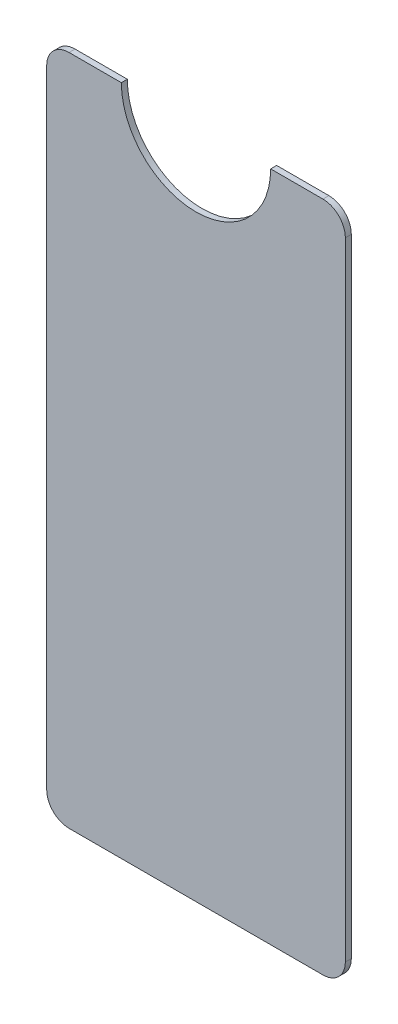
ISO-10303-21;
HEADER;
FILE_DESCRIPTION(('STEP AP214'),'2;1');
FILE_NAME('part.step','',(''),(''),'','','');
FILE_SCHEMA(('AUTOMOTIVE_DESIGN { 1 0 10303 214 1 1 1 1 }'));
ENDSEC;
DATA;
#1=APPLICATION_CONTEXT('core data for automotive mechanical design processes');
#2=APPLICATION_PROTOCOL_DEFINITION('international standard','automotive_design',2000,#1);
#3=PRODUCT_CONTEXT('',#1,'mechanical');
#4=PRODUCT('Part','Part','',(#3));
#5=PRODUCT_RELATED_PRODUCT_CATEGORY('part','',(#4));
#6=PRODUCT_DEFINITION_FORMATION('','',#4);
#7=PRODUCT_DEFINITION_CONTEXT('part definition',#1,'design');
#8=PRODUCT_DEFINITION('design','',#6,#7);
#9=PRODUCT_DEFINITION_SHAPE('','',#8);
#10=(LENGTH_UNIT() NAMED_UNIT(*) SI_UNIT(.MILLI.,.METRE.));
#11=(NAMED_UNIT(*) PLANE_ANGLE_UNIT() SI_UNIT($,.RADIAN.));
#12=(NAMED_UNIT(*) SI_UNIT($,.STERADIAN.) SOLID_ANGLE_UNIT());
#13=UNCERTAINTY_MEASURE_WITH_UNIT(LENGTH_MEASURE(1.E-05),#10,'distance_accuracy_value','');
#14=(GEOMETRIC_REPRESENTATION_CONTEXT(3) GLOBAL_UNCERTAINTY_ASSIGNED_CONTEXT((#13)) GLOBAL_UNIT_ASSIGNED_CONTEXT((#10,
#11,#12)) REPRESENTATION_CONTEXT('',''));
#15=CARTESIAN_POINT('',(0.,0.,0.));
#16=DIRECTION('',(0.,0.,1.));
#17=DIRECTION('',(1.,0.,0.));
#18=AXIS2_PLACEMENT_3D('',#15,#16,#17);
#19=CARTESIAN_POINT('',(20.,90.,0.8));
#20=DIRECTION('',(0.,0.,-1.));
#21=DIRECTION('',(-1.,0.,0.));
#22=AXIS2_PLACEMENT_3D('',#19,#20,#21);
#23=CYLINDRICAL_SURFACE('',#22,10.);
#24=CARTESIAN_POINT('',(20.,90.,0.));
#25=DIRECTION('',(0.,0.,-1.));
#26=DIRECTION('',(1.,0.,0.));
#27=AXIS2_PLACEMENT_3D('',#24,#25,#26);
#28=CIRCLE('',#27,10.);
#29=CARTESIAN_POINT('',(30.,90.,0.));
#30=VERTEX_POINT('',#29);
#31=CARTESIAN_POINT('',(10.,90.,0.));
#32=VERTEX_POINT('',#31);
#33=EDGE_CURVE('E152',#30,#32,#28,.T.);
#34=ORIENTED_EDGE('',*,*,#33,.T.);
#35=DIRECTION('',(0.,0.,-1.));
#36=VECTOR('',#35,1.);
#37=CARTESIAN_POINT('',(10.,90.,0.8));
#38=LINE('',#37,#36);
#39=CARTESIAN_POINT('',(10.,90.,0.8));
#40=VERTEX_POINT('',#39);
#41=EDGE_CURVE('E11',#40,#32,#38,.T.);
#42=ORIENTED_EDGE('',*,*,#41,.F.);
#43=CARTESIAN_POINT('',(20.,90.,0.8));
#44=DIRECTION('',(0.,0.,-1.));
#45=DIRECTION('',(1.,0.,0.));
#46=AXIS2_PLACEMENT_3D('',#43,#44,#45);
#47=CIRCLE('',#46,10.);
#48=CARTESIAN_POINT('',(30.,90.,0.8));
#49=VERTEX_POINT('',#48);
#50=EDGE_CURVE('E180',#49,#40,#47,.T.);
#51=ORIENTED_EDGE('',*,*,#50,.F.);
#52=DIRECTION('',(0.,0.,-1.));
#53=VECTOR('',#52,1.);
#54=CARTESIAN_POINT('',(30.,90.,0.8));
#55=LINE('',#54,#53);
#56=EDGE_CURVE('E148',#49,#30,#55,.T.);
#57=ORIENTED_EDGE('',*,*,#56,.T.);
#58=EDGE_LOOP('',(#34,#42,#51,#57));
#59=FACE_BOUND('',#58,.T.);
#60=ADVANCED_FACE('F39',(#59),#23,.F.);
#61=CARTESIAN_POINT('',(3.00000000000002,90.,0.8));
#62=DIRECTION('',(0.,-1.,0.));
#63=DIRECTION('',(1.,0.,0.));
#64=AXIS2_PLACEMENT_3D('',#61,#62,#63);
#65=PLANE('',#64);
#66=DIRECTION('',(-1.,0.,0.));
#67=VECTOR('',#66,1.);
#68=CARTESIAN_POINT('',(3.00000000000002,90.,0.));
#69=LINE('',#68,#67);
#70=CARTESIAN_POINT('',(3.00000000000002,90.,0.));
#71=VERTEX_POINT('',#70);
#72=EDGE_CURVE('E156',#32,#71,#69,.T.);
#73=ORIENTED_EDGE('',*,*,#72,.T.);
#74=DIRECTION('',(0.,0.,-1.));
#75=VECTOR('',#74,1.);
#76=CARTESIAN_POINT('',(3.00000000000002,90.,0.8));
#77=LINE('',#76,#75);
#78=CARTESIAN_POINT('',(3.00000000000002,90.,0.8));
#79=VERTEX_POINT('',#78);
#80=EDGE_CURVE('E48',#79,#71,#77,.T.);
#81=ORIENTED_EDGE('',*,*,#80,.F.);
#82=DIRECTION('',(-1.,0.,0.));
#83=VECTOR('',#82,1.);
#84=CARTESIAN_POINT('',(3.00000000000002,90.,0.8));
#85=LINE('',#84,#83);
#86=EDGE_CURVE('E105',#40,#79,#85,.T.);
#87=ORIENTED_EDGE('',*,*,#86,.F.);
#88=ORIENTED_EDGE('',*,*,#41,.T.);
#89=EDGE_LOOP('',(#73,#81,#87,#88));
#90=FACE_BOUND('',#89,.T.);
#91=ADVANCED_FACE('F244',(#90),#65,.F.);
#92=CARTESIAN_POINT('',(3.,87.,0.8));
#93=DIRECTION('',(0.,0.,-1.));
#94=DIRECTION('',(-1.,0.,0.));
#95=AXIS2_PLACEMENT_3D('',#92,#93,#94);
#96=CYLINDRICAL_SURFACE('',#95,2.99999999999999);
#97=CARTESIAN_POINT('',(3.,87.,0.));
#98=DIRECTION('',(0.,0.,1.));
#99=DIRECTION('',(-1.,0.,0.));
#100=AXIS2_PLACEMENT_3D('',#97,#98,#99);
#101=CIRCLE('',#100,2.99999999999999);
#102=CARTESIAN_POINT('',(0.,87.,0.));
#103=VERTEX_POINT('',#102);
#104=EDGE_CURVE('E159',#71,#103,#101,.T.);
#105=ORIENTED_EDGE('',*,*,#104,.T.);
#106=DIRECTION('',(0.,0.,-1.));
#107=VECTOR('',#106,1.);
#108=CARTESIAN_POINT('',(0.,87.,0.8));
#109=LINE('',#108,#107);
#110=CARTESIAN_POINT('',(0.,87.,0.8));
#111=VERTEX_POINT('',#110);
#112=EDGE_CURVE('E199',#111,#103,#109,.T.);
#113=ORIENTED_EDGE('',*,*,#112,.F.);
#114=CARTESIAN_POINT('',(3.,87.,0.8));
#115=DIRECTION('',(0.,0.,1.));
#116=DIRECTION('',(-1.,0.,0.));
#117=AXIS2_PLACEMENT_3D('',#114,#115,#116);
#118=CIRCLE('',#117,2.99999999999999);
#119=EDGE_CURVE('E209',#79,#111,#118,.T.);
#120=ORIENTED_EDGE('',*,*,#119,.F.);
#121=ORIENTED_EDGE('',*,*,#80,.T.);
#122=EDGE_LOOP('',(#105,#113,#120,#121));
#123=FACE_BOUND('',#122,.T.);
#124=ADVANCED_FACE('F207',(#123),#96,.T.);
#125=CARTESIAN_POINT('',(0.,3.00000000000002,0.8));
#126=DIRECTION('',(1.,0.,0.));
#127=DIRECTION('',(0.,0.,-1.));
#128=AXIS2_PLACEMENT_3D('',#125,#126,#127);
#129=PLANE('',#128);
#130=DIRECTION('',(0.,-1.,0.));
#131=VECTOR('',#130,1.);
#132=CARTESIAN_POINT('',(0.,3.00000000000002,0.));
#133=LINE('',#132,#131);
#134=CARTESIAN_POINT('',(0.,3.00000000000002,0.));
#135=VERTEX_POINT('',#134);
#136=EDGE_CURVE('E162',#103,#135,#133,.T.);
#137=ORIENTED_EDGE('',*,*,#136,.T.);
#138=DIRECTION('',(0.,0.,-1.));
#139=VECTOR('',#138,1.);
#140=CARTESIAN_POINT('',(0.,3.00000000000002,0.8));
#141=LINE('',#140,#139);
#142=CARTESIAN_POINT('',(0.,3.00000000000002,0.8));
#143=VERTEX_POINT('',#142);
#144=EDGE_CURVE('E195',#143,#135,#141,.T.);
#145=ORIENTED_EDGE('',*,*,#144,.F.);
#146=DIRECTION('',(0.,-1.,0.));
#147=VECTOR('',#146,1.);
#148=CARTESIAN_POINT('',(0.,3.00000000000002,0.8));
#149=LINE('',#148,#147);
#150=EDGE_CURVE('E228',#111,#143,#149,.T.);
#151=ORIENTED_EDGE('',*,*,#150,.F.);
#152=ORIENTED_EDGE('',*,*,#112,.T.);
#153=EDGE_LOOP('',(#137,#145,#151,#152));
#154=FACE_BOUND('',#153,.T.);
#155=ADVANCED_FACE('F218',(#154),#129,.F.);
#156=CARTESIAN_POINT('',(3.,3.,0.8));
#157=DIRECTION('',(0.,0.,-1.));
#158=DIRECTION('',(-1.,0.,0.));
#159=AXIS2_PLACEMENT_3D('',#156,#157,#158);
#160=CYLINDRICAL_SURFACE('',#159,3.);
#161=CARTESIAN_POINT('',(3.,3.,0.));
#162=DIRECTION('',(0.,0.,1.));
#163=DIRECTION('',(1.,0.,0.));
#164=AXIS2_PLACEMENT_3D('',#161,#162,#163);
#165=CIRCLE('',#164,3.);
#166=CARTESIAN_POINT('',(3.00000000000002,0.,0.));
#167=VERTEX_POINT('',#166);
#168=EDGE_CURVE('E165',#135,#167,#165,.T.);
#169=ORIENTED_EDGE('',*,*,#168,.T.);
#170=DIRECTION('',(0.,0.,-1.));
#171=VECTOR('',#170,1.);
#172=CARTESIAN_POINT('',(3.00000000000002,0.,0.8));
#173=LINE('',#172,#171);
#174=CARTESIAN_POINT('',(3.00000000000002,0.,0.8));
#175=VERTEX_POINT('',#174);
#176=EDGE_CURVE('E191',#175,#167,#173,.T.);
#177=ORIENTED_EDGE('',*,*,#176,.F.);
#178=CARTESIAN_POINT('',(3.,3.,0.8));
#179=DIRECTION('',(0.,0.,1.));
#180=DIRECTION('',(1.,0.,0.));
#181=AXIS2_PLACEMENT_3D('',#178,#179,#180);
#182=CIRCLE('',#181,3.);
#183=EDGE_CURVE('E224',#143,#175,#182,.T.);
#184=ORIENTED_EDGE('',*,*,#183,.F.);
#185=ORIENTED_EDGE('',*,*,#144,.T.);
#186=EDGE_LOOP('',(#169,#177,#184,#185));
#187=FACE_BOUND('',#186,.T.);
#188=ADVANCED_FACE('F222',(#187),#160,.T.);
#189=CARTESIAN_POINT('',(3.00000000000002,0.,0.8));
#190=DIRECTION('',(0.,1.,0.));
#191=DIRECTION('',(0.,0.,1.));
#192=AXIS2_PLACEMENT_3D('',#189,#190,#191);
#193=PLANE('',#192);
#194=DIRECTION('',(1.,0.,0.));
#195=VECTOR('',#194,1.);
#196=CARTESIAN_POINT('',(3.00000000000002,0.,0.));
#197=LINE('',#196,#195);
#198=CARTESIAN_POINT('',(37.,0.,0.));
#199=VERTEX_POINT('',#198);
#200=EDGE_CURVE('E168',#167,#199,#197,.T.);
#201=ORIENTED_EDGE('',*,*,#200,.T.);
#202=DIRECTION('',(0.,0.,-1.));
#203=VECTOR('',#202,1.);
#204=CARTESIAN_POINT('',(37.,0.,0.8));
#205=LINE('',#204,#203);
#206=CARTESIAN_POINT('',(37.,0.,0.8));
#207=VERTEX_POINT('',#206);
#208=EDGE_CURVE('E187',#207,#199,#205,.T.);
#209=ORIENTED_EDGE('',*,*,#208,.F.);
#210=DIRECTION('',(1.,0.,0.));
#211=VECTOR('',#210,1.);
#212=CARTESIAN_POINT('',(3.00000000000002,0.,0.8));
#213=LINE('',#212,#211);
#214=EDGE_CURVE('E227',#175,#207,#213,.T.);
#215=ORIENTED_EDGE('',*,*,#214,.F.);
#216=ORIENTED_EDGE('',*,*,#176,.T.);
#217=EDGE_LOOP('',(#201,#209,#215,#216));
#218=FACE_BOUND('',#217,.T.);
#219=ADVANCED_FACE('F256',(#218),#193,.F.);
#220=CARTESIAN_POINT('',(37.,3.,0.8));
#221=DIRECTION('',(0.,0.,-1.));
#222=DIRECTION('',(-1.,0.,0.));
#223=AXIS2_PLACEMENT_3D('',#220,#221,#222);
#224=CYLINDRICAL_SURFACE('',#223,3.);
#225=CARTESIAN_POINT('',(37.,3.,0.));
#226=DIRECTION('',(0.,0.,1.));
#227=DIRECTION('',(1.,0.,0.));
#228=AXIS2_PLACEMENT_3D('',#225,#226,#227);
#229=CIRCLE('',#228,3.);
#230=CARTESIAN_POINT('',(40.,3.,0.));
#231=VERTEX_POINT('',#230);
#232=EDGE_CURVE('E171',#199,#231,#229,.T.);
#233=ORIENTED_EDGE('',*,*,#232,.T.);
#234=DIRECTION('',(0.,0.,-1.));
#235=VECTOR('',#234,1.);
#236=CARTESIAN_POINT('',(40.,3.,0.8));
#237=LINE('',#236,#235);
#238=CARTESIAN_POINT('',(40.,3.,0.8));
#239=VERTEX_POINT('',#238);
#240=EDGE_CURVE('E141',#239,#231,#237,.T.);
#241=ORIENTED_EDGE('',*,*,#240,.F.);
#242=CARTESIAN_POINT('',(37.,3.,0.8));
#243=DIRECTION('',(0.,0.,1.));
#244=DIRECTION('',(1.,0.,0.));
#245=AXIS2_PLACEMENT_3D('',#242,#243,#244);
#246=CIRCLE('',#245,3.);
#247=EDGE_CURVE('E130',#207,#239,#246,.T.);
#248=ORIENTED_EDGE('',*,*,#247,.F.);
#249=ORIENTED_EDGE('',*,*,#208,.T.);
#250=EDGE_LOOP('',(#233,#241,#248,#249));
#251=FACE_BOUND('',#250,.T.);
#252=ADVANCED_FACE('F259',(#251),#224,.T.);
#253=CARTESIAN_POINT('',(40.,3.00000000000002,0.8));
#254=DIRECTION('',(-1.,0.,0.));
#255=DIRECTION('',(0.,0.,1.));
#256=AXIS2_PLACEMENT_3D('',#253,#254,#255);
#257=PLANE('',#256);
#258=DIRECTION('',(0.,1.,0.));
#259=VECTOR('',#258,1.);
#260=CARTESIAN_POINT('',(40.,3.00000000000002,0.));
#261=LINE('',#260,#259);
#262=CARTESIAN_POINT('',(40.,87.,0.));
#263=VERTEX_POINT('',#262);
#264=EDGE_CURVE('E139',#231,#263,#261,.T.);
#265=ORIENTED_EDGE('',*,*,#264,.T.);
#266=DIRECTION('',(0.,0.,-1.));
#267=VECTOR('',#266,1.);
#268=CARTESIAN_POINT('',(40.,87.,0.8));
#269=LINE('',#268,#267);
#270=CARTESIAN_POINT('',(40.,87.,0.8));
#271=VERTEX_POINT('',#270);
#272=EDGE_CURVE('E136',#271,#263,#269,.T.);
#273=ORIENTED_EDGE('',*,*,#272,.F.);
#274=DIRECTION('',(0.,1.,0.));
#275=VECTOR('',#274,1.);
#276=CARTESIAN_POINT('',(40.,3.00000000000002,0.8));
#277=LINE('',#276,#275);
#278=EDGE_CURVE('E124',#239,#271,#277,.T.);
#279=ORIENTED_EDGE('',*,*,#278,.F.);
#280=ORIENTED_EDGE('',*,*,#240,.T.);
#281=EDGE_LOOP('',(#265,#273,#279,#280));
#282=FACE_BOUND('',#281,.T.);
#283=ADVANCED_FACE('F137',(#282),#257,.F.);
#284=CARTESIAN_POINT('',(37.,87.,0.8));
#285=DIRECTION('',(0.,0.,-1.));
#286=DIRECTION('',(-1.,0.,0.));
#287=AXIS2_PLACEMENT_3D('',#284,#285,#286);
#288=CYLINDRICAL_SURFACE('',#287,3.);
#289=CARTESIAN_POINT('',(37.,87.,0.));
#290=DIRECTION('',(0.,0.,1.));
#291=DIRECTION('',(1.,0.,0.));
#292=AXIS2_PLACEMENT_3D('',#289,#290,#291);
#293=CIRCLE('',#292,3.);
#294=CARTESIAN_POINT('',(37.,90.,0.));
#295=VERTEX_POINT('',#294);
#296=EDGE_CURVE('E91',#263,#295,#293,.T.);
#297=ORIENTED_EDGE('',*,*,#296,.T.);
#298=DIRECTION('',(0.,0.,-1.));
#299=VECTOR('',#298,1.);
#300=CARTESIAN_POINT('',(37.,90.,0.8));
#301=LINE('',#300,#299);
#302=CARTESIAN_POINT('',(37.,90.,0.8));
#303=VERTEX_POINT('',#302);
#304=EDGE_CURVE('E142',#303,#295,#301,.T.);
#305=ORIENTED_EDGE('',*,*,#304,.F.);
#306=CARTESIAN_POINT('',(37.,87.,0.8));
#307=DIRECTION('',(0.,0.,1.));
#308=DIRECTION('',(1.,0.,0.));
#309=AXIS2_PLACEMENT_3D('',#306,#307,#308);
#310=CIRCLE('',#309,3.);
#311=EDGE_CURVE('E128',#271,#303,#310,.T.);
#312=ORIENTED_EDGE('',*,*,#311,.F.);
#313=ORIENTED_EDGE('',*,*,#272,.T.);
#314=EDGE_LOOP('',(#297,#305,#312,#313));
#315=FACE_BOUND('',#314,.T.);
#316=ADVANCED_FACE('F144',(#315),#288,.T.);
#317=CARTESIAN_POINT('',(30.,90.,0.8));
#318=DIRECTION('',(0.,-1.,0.));
#319=DIRECTION('',(1.,0.,0.));
#320=AXIS2_PLACEMENT_3D('',#317,#318,#319);
#321=PLANE('',#320);
#322=DIRECTION('',(-1.,0.,0.));
#323=VECTOR('',#322,1.);
#324=CARTESIAN_POINT('',(30.,90.,0.));
#325=LINE('',#324,#323);
#326=EDGE_CURVE('E97',#295,#30,#325,.T.);
#327=ORIENTED_EDGE('',*,*,#326,.T.);
#328=ORIENTED_EDGE('',*,*,#56,.F.);
#329=DIRECTION('',(-1.,0.,0.));
#330=VECTOR('',#329,1.);
#331=CARTESIAN_POINT('',(30.,90.,0.8));
#332=LINE('',#331,#330);
#333=EDGE_CURVE('E56',#303,#49,#332,.T.);
#334=ORIENTED_EDGE('',*,*,#333,.F.);
#335=ORIENTED_EDGE('',*,*,#304,.T.);
#336=EDGE_LOOP('',(#327,#328,#334,#335));
#337=FACE_BOUND('',#336,.T.);
#338=ADVANCED_FACE('F268',(#337),#321,.F.);
#339=CARTESIAN_POINT('',(20.,90.,0.8));
#340=DIRECTION('',(0.,0.,1.));
#341=DIRECTION('',(1.,0.,0.));
#342=AXIS2_PLACEMENT_3D('',#339,#340,#341);
#343=PLANE('',#342);
#344=ORIENTED_EDGE('',*,*,#50,.T.);
#345=ORIENTED_EDGE('',*,*,#86,.T.);
#346=ORIENTED_EDGE('',*,*,#119,.T.);
#347=ORIENTED_EDGE('',*,*,#150,.T.);
#348=ORIENTED_EDGE('',*,*,#183,.T.);
#349=ORIENTED_EDGE('',*,*,#214,.T.);
#350=ORIENTED_EDGE('',*,*,#247,.T.);
#351=ORIENTED_EDGE('',*,*,#278,.T.);
#352=ORIENTED_EDGE('',*,*,#311,.T.);
#353=ORIENTED_EDGE('',*,*,#333,.T.);
#354=EDGE_LOOP('',(#344,#345,#346,#347,#348,#349,#350,#351,#352,#353));
#355=FACE_BOUND('',#354,.T.);
#356=ADVANCED_FACE('F126',(#355),#343,.T.);
#357=CARTESIAN_POINT('',(20.,90.,0.));
#358=DIRECTION('',(0.,0.,1.));
#359=DIRECTION('',(1.,0.,0.));
#360=AXIS2_PLACEMENT_3D('',#357,#358,#359);
#361=PLANE('',#360);
#362=ORIENTED_EDGE('',*,*,#33,.F.);
#363=ORIENTED_EDGE('',*,*,#326,.F.);
#364=ORIENTED_EDGE('',*,*,#296,.F.);
#365=ORIENTED_EDGE('',*,*,#264,.F.);
#366=ORIENTED_EDGE('',*,*,#232,.F.);
#367=ORIENTED_EDGE('',*,*,#200,.F.);
#368=ORIENTED_EDGE('',*,*,#168,.F.);
#369=ORIENTED_EDGE('',*,*,#136,.F.);
#370=ORIENTED_EDGE('',*,*,#104,.F.);
#371=ORIENTED_EDGE('',*,*,#72,.F.);
#372=EDGE_LOOP('',(#362,#363,#364,#365,#366,#367,#368,#369,#370,#371));
#373=FACE_BOUND('',#372,.T.);
#374=ADVANCED_FACE('F213',(#373),#361,.F.);
#375=CLOSED_SHELL('',(#60,#91,#124,#155,#188,#219,#252,#283,#316,#338,#356,#374));
#376=MANIFOLD_SOLID_BREP('B2',#375);
#377=ADVANCED_BREP_SHAPE_REPRESENTATION('',(#18,#376),#14);
#378=SHAPE_DEFINITION_REPRESENTATION(#9,#377);
ENDSEC;
END-ISO-10303-21;
